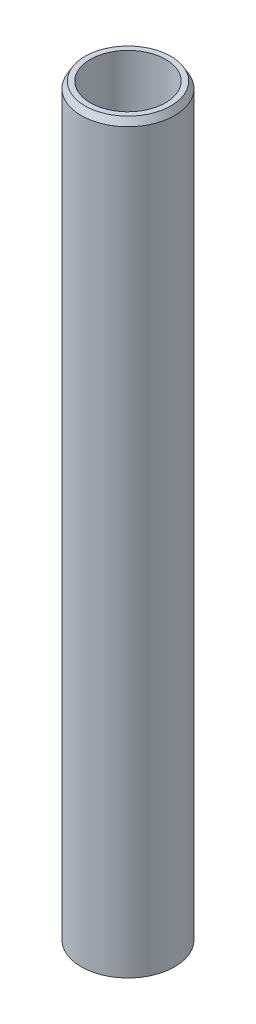
ISO-10303-21;
HEADER;
FILE_DESCRIPTION(('STEP AP214'),'2;1');
FILE_NAME('part.step','',(''),(''),'','','');
FILE_SCHEMA(('AUTOMOTIVE_DESIGN { 1 0 10303 214 1 1 1 1 }'));
ENDSEC;
DATA;
#1=APPLICATION_CONTEXT('core data for automotive mechanical design processes');
#2=APPLICATION_PROTOCOL_DEFINITION('international standard','automotive_design',2000,#1);
#3=PRODUCT_CONTEXT('',#1,'mechanical');
#4=PRODUCT('Part','Part','',(#3));
#5=PRODUCT_RELATED_PRODUCT_CATEGORY('part','',(#4));
#6=PRODUCT_DEFINITION_FORMATION('','',#4);
#7=PRODUCT_DEFINITION_CONTEXT('part definition',#1,'design');
#8=PRODUCT_DEFINITION('design','',#6,#7);
#9=PRODUCT_DEFINITION_SHAPE('','',#8);
#10=(LENGTH_UNIT() NAMED_UNIT(*) SI_UNIT(.MILLI.,.METRE.));
#11=(NAMED_UNIT(*) PLANE_ANGLE_UNIT() SI_UNIT($,.RADIAN.));
#12=(NAMED_UNIT(*) SI_UNIT($,.STERADIAN.) SOLID_ANGLE_UNIT());
#13=UNCERTAINTY_MEASURE_WITH_UNIT(LENGTH_MEASURE(1.E-05),#10,'distance_accuracy_value','');
#14=(GEOMETRIC_REPRESENTATION_CONTEXT(3) GLOBAL_UNCERTAINTY_ASSIGNED_CONTEXT((#13)) GLOBAL_UNIT_ASSIGNED_CONTEXT((#10,
#11,#12)) REPRESENTATION_CONTEXT('',''));
#15=CARTESIAN_POINT('',(0.,0.,0.));
#16=DIRECTION('',(0.,0.,1.));
#17=DIRECTION('',(1.,0.,0.));
#18=AXIS2_PLACEMENT_3D('',#15,#16,#17);
#19=CARTESIAN_POINT('',(0.,600.,0.));
#20=DIRECTION('',(0.,-1.,0.));
#21=DIRECTION('',(0.,0.,-1.));
#22=AXIS2_PLACEMENT_3D('',#19,#20,#21);
#23=CYLINDRICAL_SURFACE('',#22,37.5);
#24=CARTESIAN_POINT('',(0.,594.771123975484,0.));
#25=DIRECTION('',(0.,1.,0.));
#26=DIRECTION('',(0.,0.,1.));
#27=AXIS2_PLACEMENT_3D('',#24,#25,#26);
#28=CIRCLE('',#27,37.5);
#29=CARTESIAN_POINT('',(0.,594.771123975484,37.5));
#30=VERTEX_POINT('',#29);
#31=EDGE_CURVE('E50',#30,#30,#28,.F.);
#32=ORIENTED_EDGE('',*,*,#31,.T.);
#33=EDGE_LOOP('',(#32));
#34=FACE_BOUND('',#33,.T.);
#35=CARTESIAN_POINT('',(0.,3.01889298031344,0.));
#36=DIRECTION('',(0.,1.,0.));
#37=DIRECTION('',(0.,0.,1.));
#38=AXIS2_PLACEMENT_3D('',#35,#36,#37);
#39=CIRCLE('',#38,37.5);
#40=CARTESIAN_POINT('',(0.,3.01889298031344,37.5));
#41=VERTEX_POINT('',#40);
#42=EDGE_CURVE('E51',#41,#41,#39,.T.);
#43=ORIENTED_EDGE('',*,*,#42,.T.);
#44=EDGE_LOOP('',(#43));
#45=FACE_BOUND('',#44,.T.);
#46=ADVANCED_FACE('F39',(#34,#45),#23,.T.);
#47=CARTESIAN_POINT('',(0.,600.,0.));
#48=DIRECTION('',(0.,1.,0.));
#49=DIRECTION('',(0.,0.,1.));
#50=AXIS2_PLACEMENT_3D('',#47,#48,#49);
#51=PLANE('',#50);
#52=CARTESIAN_POINT('',(0.,600.,0.));
#53=DIRECTION('',(0.,1.,0.));
#54=DIRECTION('',(0.,0.,1.));
#55=AXIS2_PLACEMENT_3D('',#52,#53,#54);
#56=CIRCLE('',#55,34.4811070196865);
#57=CARTESIAN_POINT('',(0.,600.,34.4811070196865));
#58=VERTEX_POINT('',#57);
#59=EDGE_CURVE('E54',#58,#58,#56,.T.);
#60=ORIENTED_EDGE('',*,*,#59,.T.);
#61=EDGE_LOOP('',(#60));
#62=FACE_BOUND('',#61,.T.);
#63=CARTESIAN_POINT('',(0.,600.,0.));
#64=DIRECTION('',(0.,1.,0.));
#65=DIRECTION('',(0.,0.,1.));
#66=AXIS2_PLACEMENT_3D('',#63,#64,#65);
#67=CIRCLE('',#66,30.2197735619753);
#68=CARTESIAN_POINT('',(0.,600.,30.2197735619753));
#69=VERTEX_POINT('',#68);
#70=EDGE_CURVE('E58',#69,#69,#67,.T.);
#71=ORIENTED_EDGE('',*,*,#70,.F.);
#72=EDGE_LOOP('',(#71));
#73=FACE_BOUND('',#72,.T.);
#74=ADVANCED_FACE('F69',(#62,#73),#51,.T.);
#75=CARTESIAN_POINT('',(0.,0.,0.));
#76=DIRECTION('',(0.,1.,0.));
#77=DIRECTION('',(0.,0.,1.));
#78=AXIS2_PLACEMENT_3D('',#75,#76,#77);
#79=PLANE('',#78);
#80=CARTESIAN_POINT('',(0.,0.,0.));
#81=DIRECTION('',(0.,1.,0.));
#82=DIRECTION('',(0.,0.,1.));
#83=AXIS2_PLACEMENT_3D('',#80,#81,#82);
#84=CIRCLE('',#83,32.2711239754842);
#85=CARTESIAN_POINT('',(0.,0.,32.2711239754842));
#86=VERTEX_POINT('',#85);
#87=EDGE_CURVE('E10',#86,#86,#84,.F.);
#88=ORIENTED_EDGE('',*,*,#87,.T.);
#89=EDGE_LOOP('',(#88));
#90=FACE_BOUND('',#89,.T.);
#91=CARTESIAN_POINT('',(0.,0.,0.));
#92=DIRECTION('',(0.,1.,0.));
#93=DIRECTION('',(0.,0.,1.));
#94=AXIS2_PLACEMENT_3D('',#91,#92,#93);
#95=CIRCLE('',#94,30.2197735619753);
#96=CARTESIAN_POINT('',(0.,0.,30.2197735619753));
#97=VERTEX_POINT('',#96);
#98=EDGE_CURVE('E63',#97,#97,#95,.T.);
#99=ORIENTED_EDGE('',*,*,#98,.T.);
#100=EDGE_LOOP('',(#99));
#101=FACE_BOUND('',#100,.T.);
#102=ADVANCED_FACE('F75',(#90,#101),#79,.F.);
#103=CARTESIAN_POINT('',(0.,600.,0.));
#104=DIRECTION('',(0.,-1.,0.));
#105=DIRECTION('',(0.,0.,-1.));
#106=AXIS2_PLACEMENT_3D('',#103,#104,#105);
#107=CYLINDRICAL_SURFACE('',#106,30.2197735619753);
#108=ORIENTED_EDGE('',*,*,#70,.T.);
#109=EDGE_LOOP('',(#108));
#110=FACE_BOUND('',#109,.T.);
#111=ORIENTED_EDGE('',*,*,#98,.F.);
#112=EDGE_LOOP('',(#111));
#113=FACE_BOUND('',#112,.T.);
#114=ADVANCED_FACE('F70',(#110,#113),#107,.F.);
#115=CARTESIAN_POINT('',(0.,600.,0.));
#116=DIRECTION('',(0.,-1.,0.));
#117=DIRECTION('',(0.,0.,-1.));
#118=AXIS2_PLACEMENT_3D('',#115,#116,#117);
#119=CONICAL_SURFACE('',#118,34.4811070196865,0.523598775598291);
#120=ORIENTED_EDGE('',*,*,#31,.F.);
#121=EDGE_LOOP('',(#120));
#122=FACE_BOUND('',#121,.T.);
#123=ORIENTED_EDGE('',*,*,#59,.F.);
#124=EDGE_LOOP('',(#123));
#125=FACE_BOUND('',#124,.T.);
#126=ADVANCED_FACE('F81',(#122,#125),#119,.T.);
#127=CARTESIAN_POINT('',(0.,3.01889298031344,0.));
#128=DIRECTION('',(0.,1.,0.));
#129=DIRECTION('',(0.,0.,1.));
#130=AXIS2_PLACEMENT_3D('',#127,#128,#129);
#131=CONICAL_SURFACE('',#130,37.5,1.04719755119659);
#132=ORIENTED_EDGE('',*,*,#87,.F.);
#133=EDGE_LOOP('',(#132));
#134=FACE_BOUND('',#133,.T.);
#135=ORIENTED_EDGE('',*,*,#42,.F.);
#136=EDGE_LOOP('',(#135));
#137=FACE_BOUND('',#136,.T.);
#138=ADVANCED_FACE('F45',(#134,#137),#131,.T.);
#139=CLOSED_SHELL('',(#46,#74,#102,#114,#126,#138));
#140=MANIFOLD_SOLID_BREP('B2',#139);
#141=ADVANCED_BREP_SHAPE_REPRESENTATION('',(#18,#140),#14);
#142=SHAPE_DEFINITION_REPRESENTATION(#9,#141);
ENDSEC;
END-ISO-10303-21;
